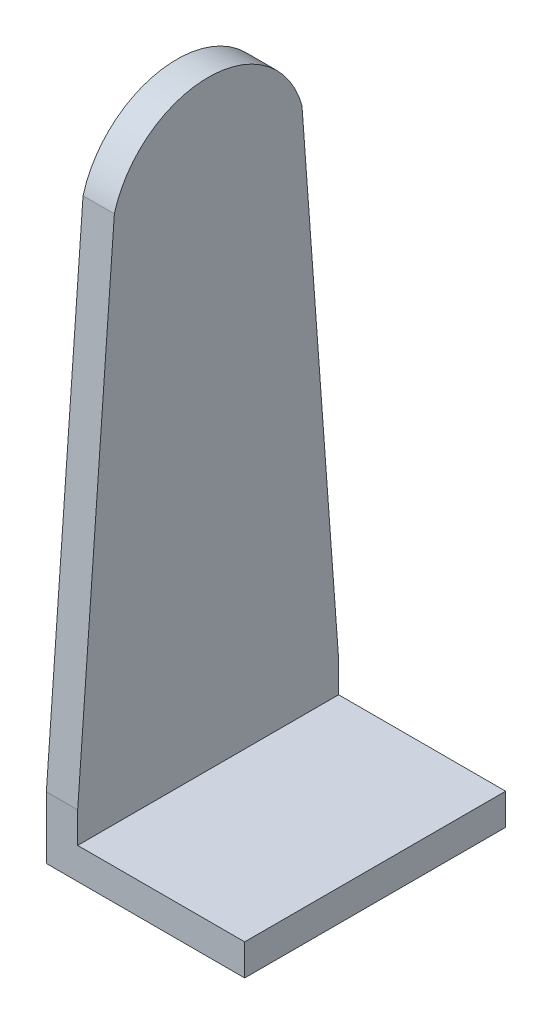
ISO-10303-21;
HEADER;
FILE_DESCRIPTION(('STEP AP214'),'2;1');
FILE_NAME('part.step','',(''),(''),'','','');
FILE_SCHEMA(('AUTOMOTIVE_DESIGN { 1 0 10303 214 1 1 1 1 }'));
ENDSEC;
DATA;
#1=APPLICATION_CONTEXT('core data for automotive mechanical design processes');
#2=APPLICATION_PROTOCOL_DEFINITION('international standard','automotive_design',2000,#1);
#3=PRODUCT_CONTEXT('',#1,'mechanical');
#4=PRODUCT('Part','Part','',(#3));
#5=PRODUCT_RELATED_PRODUCT_CATEGORY('part','',(#4));
#6=PRODUCT_DEFINITION_FORMATION('','',#4);
#7=PRODUCT_DEFINITION_CONTEXT('part definition',#1,'design');
#8=PRODUCT_DEFINITION('design','',#6,#7);
#9=PRODUCT_DEFINITION_SHAPE('','',#8);
#10=(LENGTH_UNIT() NAMED_UNIT(*) SI_UNIT(.MILLI.,.METRE.));
#11=(NAMED_UNIT(*) PLANE_ANGLE_UNIT() SI_UNIT($,.RADIAN.));
#12=(NAMED_UNIT(*) SI_UNIT($,.STERADIAN.) SOLID_ANGLE_UNIT());
#13=UNCERTAINTY_MEASURE_WITH_UNIT(LENGTH_MEASURE(1.E-05),#10,'distance_accuracy_value','');
#14=(GEOMETRIC_REPRESENTATION_CONTEXT(3) GLOBAL_UNCERTAINTY_ASSIGNED_CONTEXT((#13)) GLOBAL_UNIT_ASSIGNED_CONTEXT((#10,
#11,#12)) REPRESENTATION_CONTEXT('',''));
#15=CARTESIAN_POINT('',(0.,0.,0.));
#16=DIRECTION('',(0.,0.,1.));
#17=DIRECTION('',(1.,0.,0.));
#18=AXIS2_PLACEMENT_3D('',#15,#16,#17);
#19=CARTESIAN_POINT('',(16.5,-100.7,-12.5));
#20=DIRECTION('',(1.,0.,0.));
#21=DIRECTION('',(0.,-1.,0.));
#22=AXIS2_PLACEMENT_3D('',#19,#20,#21);
#23=PLANE('',#22);
#24=DIRECTION('',(0.,-0.997297605701587,-0.0734675823876265));
#25=VECTOR('',#24,1.);
#26=CARTESIAN_POINT('',(16.5,-100.681108800183,-12.7564416540415));
#27=LINE('',#26,#25);
#28=CARTESIAN_POINT('',(16.5,-49.5,-8.986100377806));
#29=VERTEX_POINT('',#28);
#30=CARTESIAN_POINT('',(16.5,-97.2,-12.5));
#31=VERTEX_POINT('',#30);
#32=EDGE_CURVE('E118',#29,#31,#27,.T.);
#33=ORIENTED_EDGE('',*,*,#32,.F.);
#34=CARTESIAN_POINT('',(16.5,-52.0000000000001,0.));
#35=DIRECTION('',(1.,0.,0.));
#36=DIRECTION('',(0.,0.,-1.));
#37=AXIS2_PLACEMENT_3D('',#34,#35,#36);
#38=CIRCLE('',#37,9.32737905308911);
#39=CARTESIAN_POINT('',(16.5,-49.5,8.986100377806));
#40=VERTEX_POINT('',#39);
#41=EDGE_CURVE('E154',#29,#40,#38,.T.);
#42=ORIENTED_EDGE('',*,*,#41,.T.);
#43=DIRECTION('',(0.,0.997297605701587,-0.0734675823876265));
#44=VECTOR('',#43,1.);
#45=CARTESIAN_POINT('',(16.5,-98.8493826998868,12.6215045124945));
#46=LINE('',#45,#44);
#47=CARTESIAN_POINT('',(16.5,-97.2,12.5));
#48=VERTEX_POINT('',#47);
#49=EDGE_CURVE('E148',#48,#40,#46,.T.);
#50=ORIENTED_EDGE('',*,*,#49,.F.);
#51=DIRECTION('',(0.,1.,0.));
#52=VECTOR('',#51,1.);
#53=CARTESIAN_POINT('',(16.5,-100.7,12.5));
#54=LINE('',#53,#52);
#55=CARTESIAN_POINT('',(16.5,-100.149489742783,12.5));
#56=VERTEX_POINT('',#55);
#57=EDGE_CURVE('E49',#56,#48,#54,.T.);
#58=ORIENTED_EDGE('',*,*,#57,.F.);
#59=DIRECTION('',(0.,0.,1.));
#60=VECTOR('',#59,1.);
#61=CARTESIAN_POINT('',(16.5,-100.149489742783,12.5));
#62=LINE('',#61,#60);
#63=CARTESIAN_POINT('',(16.5,-100.149489742783,-12.5));
#64=VERTEX_POINT('',#63);
#65=EDGE_CURVE('E116',#64,#56,#62,.T.);
#66=ORIENTED_EDGE('',*,*,#65,.F.);
#67=DIRECTION('',(0.,1.,0.));
#68=VECTOR('',#67,1.);
#69=CARTESIAN_POINT('',(16.5,-100.7,-12.5));
#70=LINE('',#69,#68);
#71=EDGE_CURVE('E11',#64,#31,#70,.T.);
#72=ORIENTED_EDGE('',*,*,#71,.T.);
#73=EDGE_LOOP('',(#33,#42,#50,#58,#66,#72));
#74=FACE_BOUND('',#73,.T.);
#75=ADVANCED_FACE('F39',(#74),#23,.T.);
#76=CARTESIAN_POINT('',(15.5,-70.85,12.5));
#77=DIRECTION('',(0.,0.,-1.));
#78=DIRECTION('',(0.,-1.,0.));
#79=AXIS2_PLACEMENT_3D('',#76,#77,#78);
#80=PLANE('',#79);
#81=DIRECTION('',(0.,-1.,0.));
#82=VECTOR('',#81,1.);
#83=CARTESIAN_POINT('',(13.5,0.,12.5));
#84=LINE('',#83,#82);
#85=CARTESIAN_POINT('',(13.5,-97.2,12.5));
#86=VERTEX_POINT('',#85);
#87=CARTESIAN_POINT('',(13.5,-103.149489742783,12.5));
#88=VERTEX_POINT('',#87);
#89=EDGE_CURVE('E141',#86,#88,#84,.T.);
#90=ORIENTED_EDGE('',*,*,#89,.T.);
#91=DIRECTION('',(-1.,0.,0.));
#92=VECTOR('',#91,1.);
#93=CARTESIAN_POINT('',(75.6884089130718,-103.149489742783,12.5));
#94=LINE('',#93,#92);
#95=CARTESIAN_POINT('',(32.5,-103.149489742783,12.5));
#96=VERTEX_POINT('',#95);
#97=EDGE_CURVE('E103',#96,#88,#94,.T.);
#98=ORIENTED_EDGE('',*,*,#97,.F.);
#99=DIRECTION('',(0.,-1.,0.));
#100=VECTOR('',#99,1.);
#101=CARTESIAN_POINT('',(32.5,-103.149489742783,12.5));
#102=LINE('',#101,#100);
#103=CARTESIAN_POINT('',(32.5,-100.149489742783,12.5));
#104=VERTEX_POINT('',#103);
#105=EDGE_CURVE('E108',#104,#96,#102,.T.);
#106=ORIENTED_EDGE('',*,*,#105,.F.);
#107=DIRECTION('',(-1.,0.,0.));
#108=VECTOR('',#107,1.);
#109=CARTESIAN_POINT('',(32.5,-100.149489742783,12.5));
#110=LINE('',#109,#108);
#111=EDGE_CURVE('E112',#104,#56,#110,.T.);
#112=ORIENTED_EDGE('',*,*,#111,.T.);
#113=ORIENTED_EDGE('',*,*,#57,.T.);
#114=DIRECTION('',(-1.,0.,0.));
#115=VECTOR('',#114,1.);
#116=CARTESIAN_POINT('',(16.5,-97.2,12.5));
#117=LINE('',#116,#115);
#118=EDGE_CURVE('E124',#48,#86,#117,.T.);
#119=ORIENTED_EDGE('',*,*,#118,.T.);
#120=EDGE_LOOP('',(#90,#98,#106,#112,#113,#119));
#121=FACE_BOUND('',#120,.T.);
#122=ADVANCED_FACE('F170',(#121),#80,.F.);
#123=CARTESIAN_POINT('',(15.93933982822,-101.76066017178,-12.5));
#124=DIRECTION('',(0.,0.,-1.));
#125=DIRECTION('',(1.,0.,0.));
#126=AXIS2_PLACEMENT_3D('',#123,#124,#125);
#127=PLANE('',#126);
#128=ORIENTED_EDGE('',*,*,#71,.F.);
#129=DIRECTION('',(-1.,0.,0.));
#130=VECTOR('',#129,1.);
#131=CARTESIAN_POINT('',(32.5,-100.149489742783,-12.5));
#132=LINE('',#131,#130);
#133=CARTESIAN_POINT('',(32.5,-100.149489742783,-12.5));
#134=VERTEX_POINT('',#133);
#135=EDGE_CURVE('E69',#134,#64,#132,.T.);
#136=ORIENTED_EDGE('',*,*,#135,.F.);
#137=DIRECTION('',(0.,1.,0.));
#138=VECTOR('',#137,1.);
#139=CARTESIAN_POINT('',(32.5,-100.149489742783,-12.5));
#140=LINE('',#139,#138);
#141=CARTESIAN_POINT('',(32.5,-103.149489742783,-12.5));
#142=VERTEX_POINT('',#141);
#143=EDGE_CURVE('E106',#142,#134,#140,.T.);
#144=ORIENTED_EDGE('',*,*,#143,.F.);
#145=DIRECTION('',(-1.,0.,0.));
#146=VECTOR('',#145,1.);
#147=CARTESIAN_POINT('',(75.6884089130718,-103.149489742783,-12.5));
#148=LINE('',#147,#146);
#149=CARTESIAN_POINT('',(13.5,-103.149489742783,-12.5));
#150=VERTEX_POINT('',#149);
#151=EDGE_CURVE('E90',#142,#150,#148,.T.);
#152=ORIENTED_EDGE('',*,*,#151,.T.);
#153=DIRECTION('',(0.,1.,0.));
#154=VECTOR('',#153,1.);
#155=CARTESIAN_POINT('',(13.5,0.,-12.5));
#156=LINE('',#155,#154);
#157=CARTESIAN_POINT('',(13.5,-97.2,-12.5));
#158=VERTEX_POINT('',#157);
#159=EDGE_CURVE('E139',#150,#158,#156,.T.);
#160=ORIENTED_EDGE('',*,*,#159,.T.);
#161=DIRECTION('',(-1.,0.,0.));
#162=VECTOR('',#161,1.);
#163=CARTESIAN_POINT('',(16.5,-97.2,-12.5));
#164=LINE('',#163,#162);
#165=EDGE_CURVE('E129',#31,#158,#164,.T.);
#166=ORIENTED_EDGE('',*,*,#165,.F.);
#167=EDGE_LOOP('',(#128,#136,#144,#152,#160,#166));
#168=FACE_BOUND('',#167,.T.);
#169=ADVANCED_FACE('F41',(#168),#127,.T.);
#170=CARTESIAN_POINT('',(75.6884089130718,-103.149489742783,-12.5));
#171=DIRECTION('',(0.,-1.,0.));
#172=DIRECTION('',(0.,0.,-1.));
#173=AXIS2_PLACEMENT_3D('',#170,#171,#172);
#174=PLANE('',#173);
#175=DIRECTION('',(0.,0.,-1.));
#176=VECTOR('',#175,1.);
#177=CARTESIAN_POINT('',(13.5,-103.149489742783,-12.5));
#178=LINE('',#177,#176);
#179=EDGE_CURVE('E97',#88,#150,#178,.T.);
#180=ORIENTED_EDGE('',*,*,#179,.T.);
#181=ORIENTED_EDGE('',*,*,#151,.F.);
#182=DIRECTION('',(0.,0.,-1.));
#183=VECTOR('',#182,1.);
#184=CARTESIAN_POINT('',(32.5,-103.149489742783,-12.5));
#185=LINE('',#184,#183);
#186=EDGE_CURVE('E94',#96,#142,#185,.T.);
#187=ORIENTED_EDGE('',*,*,#186,.F.);
#188=ORIENTED_EDGE('',*,*,#97,.T.);
#189=EDGE_LOOP('',(#180,#181,#187,#188));
#190=FACE_BOUND('',#189,.T.);
#191=ADVANCED_FACE('F92',(#190),#174,.T.);
#192=CARTESIAN_POINT('',(32.5,-100.149489742783,12.5));
#193=DIRECTION('',(0.,-1.,0.));
#194=DIRECTION('',(0.,0.,-1.));
#195=AXIS2_PLACEMENT_3D('',#192,#193,#194);
#196=PLANE('',#195);
#197=ORIENTED_EDGE('',*,*,#65,.T.);
#198=ORIENTED_EDGE('',*,*,#111,.F.);
#199=DIRECTION('',(0.,0.,1.));
#200=VECTOR('',#199,1.);
#201=CARTESIAN_POINT('',(32.5,-100.149489742783,12.5));
#202=LINE('',#201,#200);
#203=EDGE_CURVE('E58',#134,#104,#202,.T.);
#204=ORIENTED_EDGE('',*,*,#203,.F.);
#205=ORIENTED_EDGE('',*,*,#135,.T.);
#206=EDGE_LOOP('',(#197,#198,#204,#205));
#207=FACE_BOUND('',#206,.T.);
#208=ADVANCED_FACE('F200',(#207),#196,.F.);
#209=CARTESIAN_POINT('',(32.5,0.,0.));
#210=DIRECTION('',(-1.,0.,0.));
#211=DIRECTION('',(0.,0.,1.));
#212=AXIS2_PLACEMENT_3D('',#209,#210,#211);
#213=PLANE('',#212);
#214=ORIENTED_EDGE('',*,*,#105,.T.);
#215=ORIENTED_EDGE('',*,*,#186,.T.);
#216=ORIENTED_EDGE('',*,*,#143,.T.);
#217=ORIENTED_EDGE('',*,*,#203,.T.);
#218=EDGE_LOOP('',(#214,#215,#216,#217));
#219=FACE_BOUND('',#218,.T.);
#220=ADVANCED_FACE('F105',(#219),#213,.F.);
#221=CARTESIAN_POINT('',(22.,-49.5,-8.986100377806));
#222=DIRECTION('',(0.,-0.0734675823876265,0.997297605701587));
#223=DIRECTION('',(0.,-0.997297605701587,-0.0734675823876265));
#224=AXIS2_PLACEMENT_3D('',#221,#222,#223);
#225=PLANE('',#224);
#226=ORIENTED_EDGE('',*,*,#32,.T.);
#227=ORIENTED_EDGE('',*,*,#165,.T.);
#228=DIRECTION('',(0.,0.997297605701587,0.0734675823876265));
#229=VECTOR('',#228,1.);
#230=CARTESIAN_POINT('',(13.5,0.391227443813302,-5.31078035127329));
#231=LINE('',#230,#229);
#232=CARTESIAN_POINT('',(13.5,-49.5,-8.986100377806));
#233=VERTEX_POINT('',#232);
#234=EDGE_CURVE('E136',#158,#233,#231,.T.);
#235=ORIENTED_EDGE('',*,*,#234,.T.);
#236=DIRECTION('',(1.,0.,0.));
#237=VECTOR('',#236,1.);
#238=CARTESIAN_POINT('',(14.5,-49.5,-8.986100377806));
#239=LINE('',#238,#237);
#240=EDGE_CURVE('E43',#233,#29,#239,.T.);
#241=ORIENTED_EDGE('',*,*,#240,.T.);
#242=EDGE_LOOP('',(#226,#227,#235,#241));
#243=FACE_BOUND('',#242,.T.);
#244=ADVANCED_FACE('F133',(#243),#225,.F.);
#245=CARTESIAN_POINT('',(22.,-49.5,8.986100377806));
#246=DIRECTION('',(0.,-0.0734675823876265,-0.997297605701587));
#247=DIRECTION('',(0.,0.997297605701587,-0.0734675823876265));
#248=AXIS2_PLACEMENT_3D('',#245,#246,#247);
#249=PLANE('',#248);
#250=ORIENTED_EDGE('',*,*,#49,.T.);
#251=DIRECTION('',(1.,0.,0.));
#252=VECTOR('',#251,1.);
#253=CARTESIAN_POINT('',(14.5,-49.5,8.986100377806));
#254=LINE('',#253,#252);
#255=CARTESIAN_POINT('',(13.5,-49.5,8.986100377806));
#256=VERTEX_POINT('',#255);
#257=EDGE_CURVE('E102',#256,#40,#254,.T.);
#258=ORIENTED_EDGE('',*,*,#257,.F.);
#259=DIRECTION('',(0.,-0.997297605701587,0.0734675823876265));
#260=VECTOR('',#259,1.);
#261=CARTESIAN_POINT('',(13.5,0.391227443813302,5.31078035127329));
#262=LINE('',#261,#260);
#263=EDGE_CURVE('E161',#256,#86,#262,.T.);
#264=ORIENTED_EDGE('',*,*,#263,.T.);
#265=ORIENTED_EDGE('',*,*,#118,.F.);
#266=EDGE_LOOP('',(#250,#258,#264,#265));
#267=FACE_BOUND('',#266,.T.);
#268=ADVANCED_FACE('F177',(#267),#249,.F.);
#269=CARTESIAN_POINT('',(13.5,-52.0000000000001,0.));
#270=DIRECTION('',(1.,0.,0.));
#271=DIRECTION('',(0.,0.,-1.));
#272=AXIS2_PLACEMENT_3D('',#269,#270,#271);
#273=CYLINDRICAL_SURFACE('',#272,9.32737905308911);
#274=ORIENTED_EDGE('',*,*,#41,.F.);
#275=ORIENTED_EDGE('',*,*,#240,.F.);
#276=CARTESIAN_POINT('',(13.5,-52.0000000000001,0.));
#277=DIRECTION('',(1.,0.,0.));
#278=DIRECTION('',(0.,0.,-1.));
#279=AXIS2_PLACEMENT_3D('',#276,#277,#278);
#280=CIRCLE('',#279,9.32737905308911);
#281=EDGE_CURVE('E147',#233,#256,#280,.T.);
#282=ORIENTED_EDGE('',*,*,#281,.T.);
#283=ORIENTED_EDGE('',*,*,#257,.T.);
#284=EDGE_LOOP('',(#274,#275,#282,#283));
#285=FACE_BOUND('',#284,.T.);
#286=ADVANCED_FACE('F180',(#285),#273,.T.);
#287=CARTESIAN_POINT('',(13.5,0.,0.));
#288=DIRECTION('',(1.,0.,0.));
#289=DIRECTION('',(0.,0.,-1.));
#290=AXIS2_PLACEMENT_3D('',#287,#288,#289);
#291=PLANE('',#290);
#292=ORIENTED_EDGE('',*,*,#281,.F.);
#293=ORIENTED_EDGE('',*,*,#234,.F.);
#294=ORIENTED_EDGE('',*,*,#159,.F.);
#295=ORIENTED_EDGE('',*,*,#179,.F.);
#296=ORIENTED_EDGE('',*,*,#89,.F.);
#297=ORIENTED_EDGE('',*,*,#263,.F.);
#298=EDGE_LOOP('',(#292,#293,#294,#295,#296,#297));
#299=FACE_BOUND('',#298,.T.);
#300=ADVANCED_FACE('F144',(#299),#291,.F.);
#301=CLOSED_SHELL('',(#75,#122,#169,#191,#208,#220,#244,#268,#286,#300));
#302=MANIFOLD_SOLID_BREP('B2',#301);
#303=ADVANCED_BREP_SHAPE_REPRESENTATION('',(#18,#302),#14);
#304=SHAPE_DEFINITION_REPRESENTATION(#9,#303);
ENDSEC;
END-ISO-10303-21;
